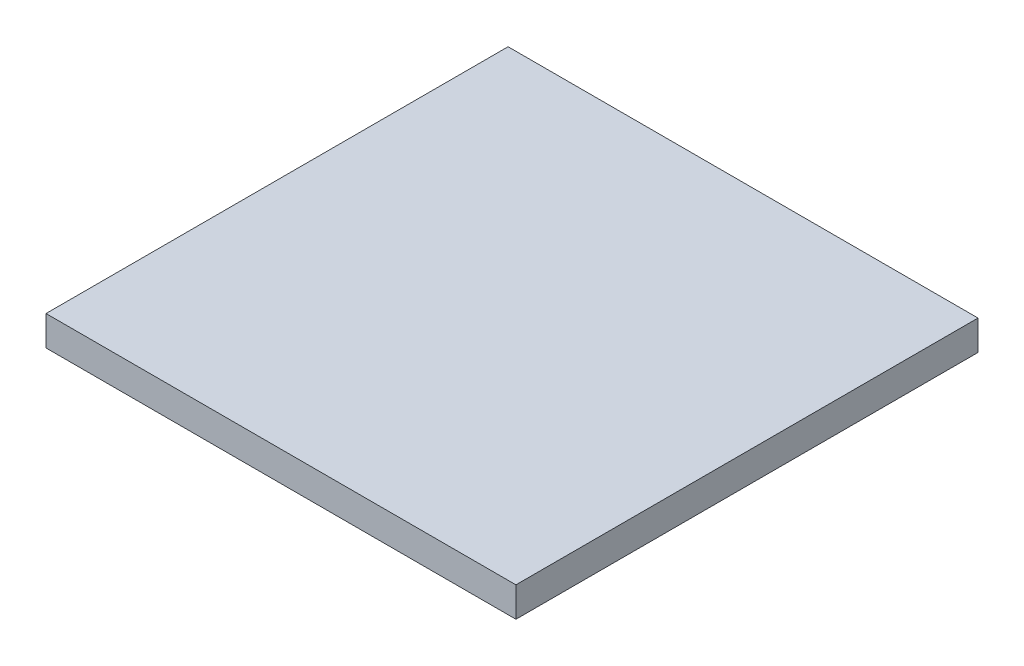
ISO-10303-21;
HEADER;
FILE_DESCRIPTION(('STEP AP214'),'2;1');
FILE_NAME('part.step','',(''),(''),'','','');
FILE_SCHEMA(('AUTOMOTIVE_DESIGN { 1 0 10303 214 1 1 1 1 }'));
ENDSEC;
DATA;
#1=APPLICATION_CONTEXT('core data for automotive mechanical design processes');
#2=APPLICATION_PROTOCOL_DEFINITION('international standard','automotive_design',2000,#1);
#3=PRODUCT_CONTEXT('',#1,'mechanical');
#4=PRODUCT('Part','Part','',(#3));
#5=PRODUCT_RELATED_PRODUCT_CATEGORY('part','',(#4));
#6=PRODUCT_DEFINITION_FORMATION('','',#4);
#7=PRODUCT_DEFINITION_CONTEXT('part definition',#1,'design');
#8=PRODUCT_DEFINITION('design','',#6,#7);
#9=PRODUCT_DEFINITION_SHAPE('','',#8);
#10=(LENGTH_UNIT() NAMED_UNIT(*) SI_UNIT(.MILLI.,.METRE.));
#11=(NAMED_UNIT(*) PLANE_ANGLE_UNIT() SI_UNIT($,.RADIAN.));
#12=(NAMED_UNIT(*) SI_UNIT($,.STERADIAN.) SOLID_ANGLE_UNIT());
#13=UNCERTAINTY_MEASURE_WITH_UNIT(LENGTH_MEASURE(1.E-05),#10,'distance_accuracy_value','');
#14=(GEOMETRIC_REPRESENTATION_CONTEXT(3) GLOBAL_UNCERTAINTY_ASSIGNED_CONTEXT((#13)) GLOBAL_UNIT_ASSIGNED_CONTEXT((#10,
#11,#12)) REPRESENTATION_CONTEXT('',''));
#15=CARTESIAN_POINT('',(0.,0.,0.));
#16=DIRECTION('',(0.,0.,1.));
#17=DIRECTION('',(1.,0.,0.));
#18=AXIS2_PLACEMENT_3D('',#15,#16,#17);
#19=CARTESIAN_POINT('',(300.,38.1,-295.));
#20=DIRECTION('',(-1.,0.,0.));
#21=DIRECTION('',(0.,0.,1.));
#22=AXIS2_PLACEMENT_3D('',#19,#20,#21);
#23=PLANE('',#22);
#24=DIRECTION('',(0.,0.,-1.));
#25=VECTOR('',#24,1.);
#26=CARTESIAN_POINT('',(300.,0.,-295.));
#27=LINE('',#26,#25);
#28=CARTESIAN_POINT('',(300.,0.,295.));
#29=VERTEX_POINT('',#28);
#30=CARTESIAN_POINT('',(300.,0.,-295.));
#31=VERTEX_POINT('',#30);
#32=EDGE_CURVE('E96',#29,#31,#27,.T.);
#33=ORIENTED_EDGE('',*,*,#32,.T.);
#34=DIRECTION('',(0.,-1.,0.));
#35=VECTOR('',#34,1.);
#36=CARTESIAN_POINT('',(300.,38.1,-295.));
#37=LINE('',#36,#35);
#38=CARTESIAN_POINT('',(300.,38.1,-295.));
#39=VERTEX_POINT('',#38);
#40=EDGE_CURVE('E11',#39,#31,#37,.T.);
#41=ORIENTED_EDGE('',*,*,#40,.F.);
#42=DIRECTION('',(0.,0.,-1.));
#43=VECTOR('',#42,1.);
#44=CARTESIAN_POINT('',(300.,38.1,-295.));
#45=LINE('',#44,#43);
#46=CARTESIAN_POINT('',(300.,38.1,295.));
#47=VERTEX_POINT('',#46);
#48=EDGE_CURVE('E84',#47,#39,#45,.T.);
#49=ORIENTED_EDGE('',*,*,#48,.F.);
#50=DIRECTION('',(0.,-1.,0.));
#51=VECTOR('',#50,1.);
#52=CARTESIAN_POINT('',(300.,38.1,295.));
#53=LINE('',#52,#51);
#54=EDGE_CURVE('E92',#47,#29,#53,.T.);
#55=ORIENTED_EDGE('',*,*,#54,.T.);
#56=EDGE_LOOP('',(#33,#41,#49,#55));
#57=FACE_BOUND('',#56,.T.);
#58=ADVANCED_FACE('F33',(#57),#23,.F.);
#59=CARTESIAN_POINT('',(-300.,38.1,-295.));
#60=DIRECTION('',(0.,0.,1.));
#61=DIRECTION('',(1.,0.,0.));
#62=AXIS2_PLACEMENT_3D('',#59,#60,#61);
#63=PLANE('',#62);
#64=DIRECTION('',(-1.,0.,0.));
#65=VECTOR('',#64,1.);
#66=CARTESIAN_POINT('',(-300.,0.,-295.));
#67=LINE('',#66,#65);
#68=CARTESIAN_POINT('',(-300.,0.,-295.));
#69=VERTEX_POINT('',#68);
#70=EDGE_CURVE('E88',#31,#69,#67,.T.);
#71=ORIENTED_EDGE('',*,*,#70,.T.);
#72=DIRECTION('',(0.,-1.,0.));
#73=VECTOR('',#72,1.);
#74=CARTESIAN_POINT('',(-300.,38.1,-295.));
#75=LINE('',#74,#73);
#76=CARTESIAN_POINT('',(-300.,38.1,-295.));
#77=VERTEX_POINT('',#76);
#78=EDGE_CURVE('E41',#77,#69,#75,.T.);
#79=ORIENTED_EDGE('',*,*,#78,.F.);
#80=DIRECTION('',(-1.,0.,0.));
#81=VECTOR('',#80,1.);
#82=CARTESIAN_POINT('',(-300.,38.1,-295.));
#83=LINE('',#82,#81);
#84=EDGE_CURVE('E79',#39,#77,#83,.T.);
#85=ORIENTED_EDGE('',*,*,#84,.F.);
#86=ORIENTED_EDGE('',*,*,#40,.T.);
#87=EDGE_LOOP('',(#71,#79,#85,#86));
#88=FACE_BOUND('',#87,.T.);
#89=ADVANCED_FACE('F87',(#88),#63,.F.);
#90=CARTESIAN_POINT('',(-300.,38.1,-295.));
#91=DIRECTION('',(1.,0.,0.));
#92=DIRECTION('',(0.,0.,-1.));
#93=AXIS2_PLACEMENT_3D('',#90,#91,#92);
#94=PLANE('',#93);
#95=DIRECTION('',(0.,0.,1.));
#96=VECTOR('',#95,1.);
#97=CARTESIAN_POINT('',(-300.,0.,-295.));
#98=LINE('',#97,#96);
#99=CARTESIAN_POINT('',(-300.,0.,295.));
#100=VERTEX_POINT('',#99);
#101=EDGE_CURVE('E66',#69,#100,#98,.T.);
#102=ORIENTED_EDGE('',*,*,#101,.T.);
#103=DIRECTION('',(0.,-1.,0.));
#104=VECTOR('',#103,1.);
#105=CARTESIAN_POINT('',(-300.,38.1,295.));
#106=LINE('',#105,#104);
#107=CARTESIAN_POINT('',(-300.,38.1,295.));
#108=VERTEX_POINT('',#107);
#109=EDGE_CURVE('E89',#108,#100,#106,.T.);
#110=ORIENTED_EDGE('',*,*,#109,.F.);
#111=DIRECTION('',(0.,0.,1.));
#112=VECTOR('',#111,1.);
#113=CARTESIAN_POINT('',(-300.,38.1,-295.));
#114=LINE('',#113,#112);
#115=EDGE_CURVE('E82',#77,#108,#114,.T.);
#116=ORIENTED_EDGE('',*,*,#115,.F.);
#117=ORIENTED_EDGE('',*,*,#78,.T.);
#118=EDGE_LOOP('',(#102,#110,#116,#117));
#119=FACE_BOUND('',#118,.T.);
#120=ADVANCED_FACE('F90',(#119),#94,.F.);
#121=CARTESIAN_POINT('',(-300.,38.1,295.));
#122=DIRECTION('',(0.,0.,-1.));
#123=DIRECTION('',(-1.,0.,0.));
#124=AXIS2_PLACEMENT_3D('',#121,#122,#123);
#125=PLANE('',#124);
#126=DIRECTION('',(1.,0.,0.));
#127=VECTOR('',#126,1.);
#128=CARTESIAN_POINT('',(-300.,0.,295.));
#129=LINE('',#128,#127);
#130=EDGE_CURVE('E72',#100,#29,#129,.T.);
#131=ORIENTED_EDGE('',*,*,#130,.T.);
#132=ORIENTED_EDGE('',*,*,#54,.F.);
#133=DIRECTION('',(1.,0.,0.));
#134=VECTOR('',#133,1.);
#135=CARTESIAN_POINT('',(-300.,38.1,295.));
#136=LINE('',#135,#134);
#137=EDGE_CURVE('E49',#108,#47,#136,.T.);
#138=ORIENTED_EDGE('',*,*,#137,.F.);
#139=ORIENTED_EDGE('',*,*,#109,.T.);
#140=EDGE_LOOP('',(#131,#132,#138,#139));
#141=FACE_BOUND('',#140,.T.);
#142=ADVANCED_FACE('F103',(#141),#125,.F.);
#143=CARTESIAN_POINT('',(0.,38.1,0.));
#144=DIRECTION('',(0.,1.,0.));
#145=DIRECTION('',(0.,0.,1.));
#146=AXIS2_PLACEMENT_3D('',#143,#144,#145);
#147=PLANE('',#146);
#148=ORIENTED_EDGE('',*,*,#48,.T.);
#149=ORIENTED_EDGE('',*,*,#84,.T.);
#150=ORIENTED_EDGE('',*,*,#115,.T.);
#151=ORIENTED_EDGE('',*,*,#137,.T.);
#152=EDGE_LOOP('',(#148,#149,#150,#151));
#153=FACE_BOUND('',#152,.T.);
#154=ADVANCED_FACE('F80',(#153),#147,.T.);
#155=CARTESIAN_POINT('',(0.,0.,0.));
#156=DIRECTION('',(0.,1.,0.));
#157=DIRECTION('',(0.,0.,1.));
#158=AXIS2_PLACEMENT_3D('',#155,#156,#157);
#159=PLANE('',#158);
#160=ORIENTED_EDGE('',*,*,#32,.F.);
#161=ORIENTED_EDGE('',*,*,#130,.F.);
#162=ORIENTED_EDGE('',*,*,#101,.F.);
#163=ORIENTED_EDGE('',*,*,#70,.F.);
#164=EDGE_LOOP('',(#160,#161,#162,#163));
#165=FACE_BOUND('',#164,.T.);
#166=ADVANCED_FACE('F106',(#165),#159,.F.);
#167=CLOSED_SHELL('',(#58,#89,#120,#142,#154,#166));
#168=MANIFOLD_SOLID_BREP('B2',#167);
#169=ADVANCED_BREP_SHAPE_REPRESENTATION('',(#18,#168),#14);
#170=SHAPE_DEFINITION_REPRESENTATION(#9,#169);
ENDSEC;
END-ISO-10303-21;
